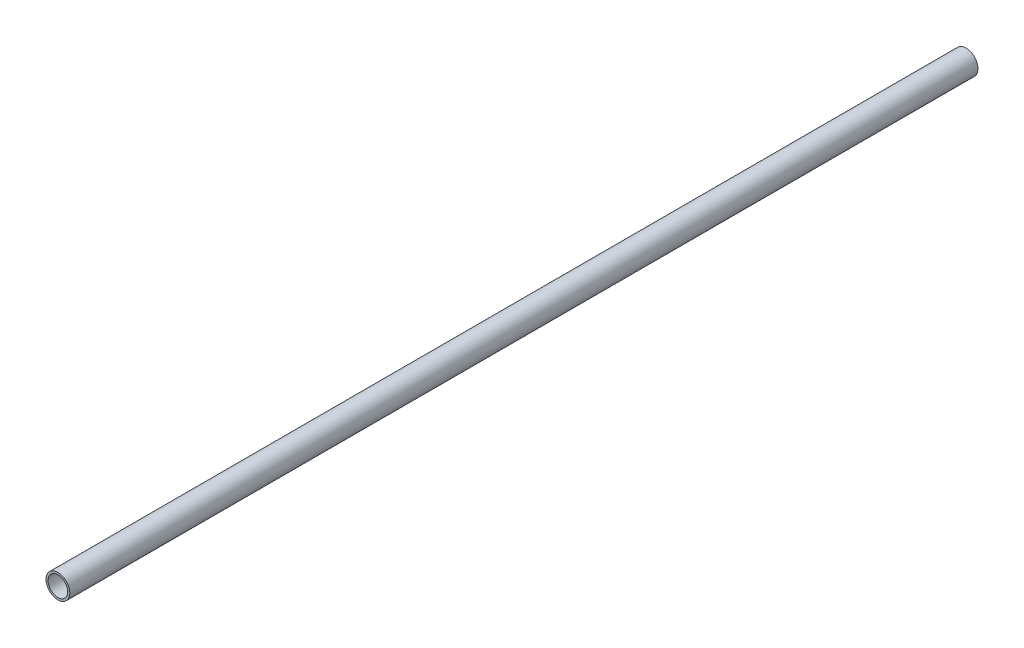
ISO-10303-21;
HEADER;
FILE_DESCRIPTION(('STEP AP214'),'2;1');
FILE_NAME('part.step','',(''),(''),'','','');
FILE_SCHEMA(('AUTOMOTIVE_DESIGN { 1 0 10303 214 1 1 1 1 }'));
ENDSEC;
DATA;
#1=APPLICATION_CONTEXT('core data for automotive mechanical design processes');
#2=APPLICATION_PROTOCOL_DEFINITION('international standard','automotive_design',2000,#1);
#3=PRODUCT_CONTEXT('',#1,'mechanical');
#4=PRODUCT('Part','Part','',(#3));
#5=PRODUCT_RELATED_PRODUCT_CATEGORY('part','',(#4));
#6=PRODUCT_DEFINITION_FORMATION('','',#4);
#7=PRODUCT_DEFINITION_CONTEXT('part definition',#1,'design');
#8=PRODUCT_DEFINITION('design','',#6,#7);
#9=PRODUCT_DEFINITION_SHAPE('','',#8);
#10=(LENGTH_UNIT() NAMED_UNIT(*) SI_UNIT(.MILLI.,.METRE.));
#11=(NAMED_UNIT(*) PLANE_ANGLE_UNIT() SI_UNIT($,.RADIAN.));
#12=(NAMED_UNIT(*) SI_UNIT($,.STERADIAN.) SOLID_ANGLE_UNIT());
#13=UNCERTAINTY_MEASURE_WITH_UNIT(LENGTH_MEASURE(1.E-05),#10,'distance_accuracy_value','');
#14=(GEOMETRIC_REPRESENTATION_CONTEXT(3) GLOBAL_UNCERTAINTY_ASSIGNED_CONTEXT((#13)) GLOBAL_UNIT_ASSIGNED_CONTEXT((#10,
#11,#12)) REPRESENTATION_CONTEXT('',''));
#15=CARTESIAN_POINT('',(0.,0.,0.));
#16=DIRECTION('',(0.,0.,1.));
#17=DIRECTION('',(1.,0.,0.));
#18=AXIS2_PLACEMENT_3D('',#15,#16,#17);
#19=CARTESIAN_POINT('',(0.,0.,457.2));
#20=DIRECTION('',(0.,0.,1.));
#21=DIRECTION('',(1.,0.,0.));
#22=AXIS2_PLACEMENT_3D('',#19,#20,#21);
#23=PLANE('',#22);
#24=CARTESIAN_POINT('',(0.,0.,457.2));
#25=DIRECTION('',(0.,0.,1.));
#26=DIRECTION('',(1.,0.,0.));
#27=AXIS2_PLACEMENT_3D('',#24,#25,#26);
#28=CIRCLE('',#27,5.9944);
#29=CARTESIAN_POINT('',(5.9944,0.,457.2));
#30=VERTEX_POINT('',#29);
#31=EDGE_CURVE('E10',#30,#30,#28,.T.);
#32=ORIENTED_EDGE('',*,*,#31,.T.);
#33=EDGE_LOOP('',(#32));
#34=FACE_BOUND('',#33,.T.);
#35=CARTESIAN_POINT('',(0.,0.,457.2));
#36=DIRECTION('',(0.,0.,1.));
#37=DIRECTION('',(1.,0.,0.));
#38=AXIS2_PLACEMENT_3D('',#35,#36,#37);
#39=CIRCLE('',#38,4.953);
#40=CARTESIAN_POINT('',(4.953,0.,457.2));
#41=VERTEX_POINT('',#40);
#42=EDGE_CURVE('E41',#41,#41,#39,.T.);
#43=ORIENTED_EDGE('',*,*,#42,.F.);
#44=EDGE_LOOP('',(#43));
#45=FACE_BOUND('',#44,.T.);
#46=ADVANCED_FACE('F30',(#34,#45),#23,.T.);
#47=CARTESIAN_POINT('',(0.,0.,0.));
#48=DIRECTION('',(0.,0.,1.));
#49=DIRECTION('',(1.,0.,0.));
#50=AXIS2_PLACEMENT_3D('',#47,#48,#49);
#51=PLANE('',#50);
#52=CARTESIAN_POINT('',(0.,0.,0.));
#53=DIRECTION('',(0.,0.,1.));
#54=DIRECTION('',(1.,0.,0.));
#55=AXIS2_PLACEMENT_3D('',#52,#53,#54);
#56=CIRCLE('',#55,5.9944);
#57=CARTESIAN_POINT('',(5.9944,0.,0.));
#58=VERTEX_POINT('',#57);
#59=EDGE_CURVE('E34',#58,#58,#56,.T.);
#60=ORIENTED_EDGE('',*,*,#59,.F.);
#61=EDGE_LOOP('',(#60));
#62=FACE_BOUND('',#61,.T.);
#63=CARTESIAN_POINT('',(0.,0.,0.));
#64=DIRECTION('',(0.,0.,1.));
#65=DIRECTION('',(1.,0.,0.));
#66=AXIS2_PLACEMENT_3D('',#63,#64,#65);
#67=CIRCLE('',#66,4.953);
#68=CARTESIAN_POINT('',(4.953,0.,0.));
#69=VERTEX_POINT('',#68);
#70=EDGE_CURVE('E43',#69,#69,#67,.T.);
#71=ORIENTED_EDGE('',*,*,#70,.T.);
#72=EDGE_LOOP('',(#71));
#73=FACE_BOUND('',#72,.T.);
#74=ADVANCED_FACE('F53',(#62,#73),#51,.F.);
#75=CARTESIAN_POINT('',(0.,0.,457.2));
#76=DIRECTION('',(0.,0.,-1.));
#77=DIRECTION('',(-1.,0.,0.));
#78=AXIS2_PLACEMENT_3D('',#75,#76,#77);
#79=CYLINDRICAL_SURFACE('',#78,5.9944);
#80=ORIENTED_EDGE('',*,*,#31,.F.);
#81=EDGE_LOOP('',(#80));
#82=FACE_BOUND('',#81,.T.);
#83=ORIENTED_EDGE('',*,*,#59,.T.);
#84=EDGE_LOOP('',(#83));
#85=FACE_BOUND('',#84,.T.);
#86=ADVANCED_FACE('F32',(#82,#85),#79,.T.);
#87=CARTESIAN_POINT('',(0.,0.,457.2));
#88=DIRECTION('',(0.,0.,-1.));
#89=DIRECTION('',(-1.,0.,0.));
#90=AXIS2_PLACEMENT_3D('',#87,#88,#89);
#91=CYLINDRICAL_SURFACE('',#90,4.953);
#92=ORIENTED_EDGE('',*,*,#42,.T.);
#93=EDGE_LOOP('',(#92));
#94=FACE_BOUND('',#93,.T.);
#95=ORIENTED_EDGE('',*,*,#70,.F.);
#96=EDGE_LOOP('',(#95));
#97=FACE_BOUND('',#96,.T.);
#98=ADVANCED_FACE('F49',(#94,#97),#91,.F.);
#99=CLOSED_SHELL('',(#46,#74,#86,#98));
#100=MANIFOLD_SOLID_BREP('B2',#99);
#101=ADVANCED_BREP_SHAPE_REPRESENTATION('',(#18,#100),#14);
#102=SHAPE_DEFINITION_REPRESENTATION(#9,#101);
ENDSEC;
END-ISO-10303-21;
